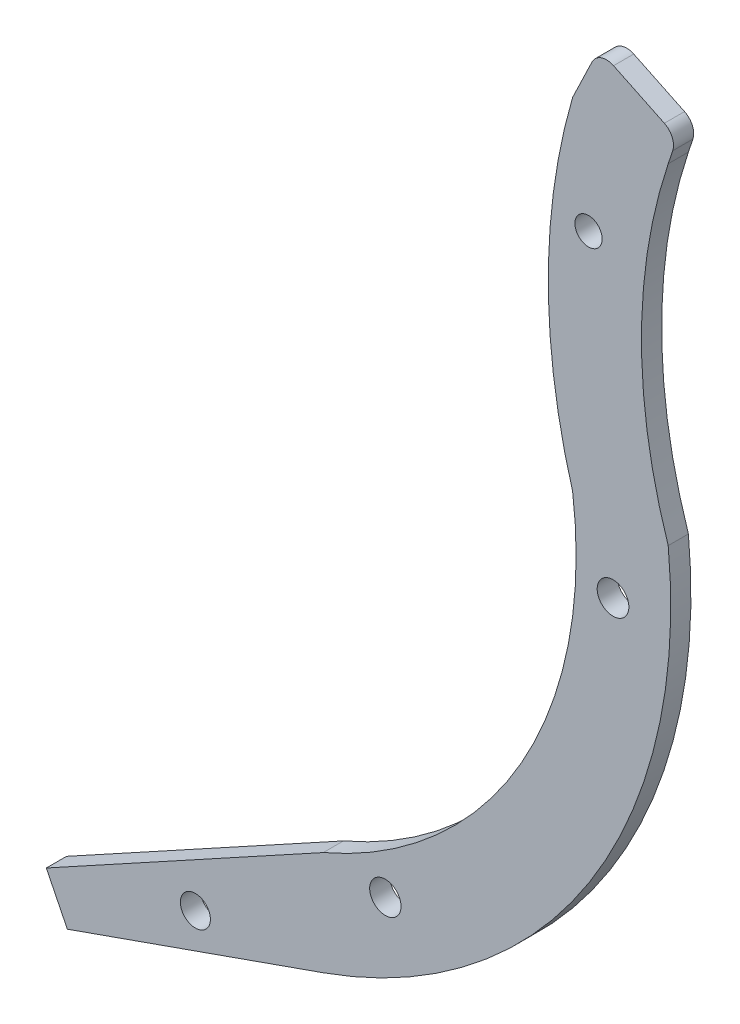
ISO-10303-21;
HEADER;
FILE_DESCRIPTION(('STEP AP214'),'2;1');
FILE_NAME('part.step','',(''),(''),'','','');
FILE_SCHEMA(('AUTOMOTIVE_DESIGN { 1 0 10303 214 1 1 1 1 }'));
ENDSEC;
DATA;
#1=APPLICATION_CONTEXT('core data for automotive mechanical design processes');
#2=APPLICATION_PROTOCOL_DEFINITION('international standard','automotive_design',2000,#1);
#3=PRODUCT_CONTEXT('',#1,'mechanical');
#4=PRODUCT('Part','Part','',(#3));
#5=PRODUCT_RELATED_PRODUCT_CATEGORY('part','',(#4));
#6=PRODUCT_DEFINITION_FORMATION('','',#4);
#7=PRODUCT_DEFINITION_CONTEXT('part definition',#1,'design');
#8=PRODUCT_DEFINITION('design','',#6,#7);
#9=PRODUCT_DEFINITION_SHAPE('','',#8);
#10=(LENGTH_UNIT() NAMED_UNIT(*) SI_UNIT(.MILLI.,.METRE.));
#11=(NAMED_UNIT(*) PLANE_ANGLE_UNIT() SI_UNIT($,.RADIAN.));
#12=(NAMED_UNIT(*) SI_UNIT($,.STERADIAN.) SOLID_ANGLE_UNIT());
#13=UNCERTAINTY_MEASURE_WITH_UNIT(LENGTH_MEASURE(1.E-05),#10,'distance_accuracy_value','');
#14=(GEOMETRIC_REPRESENTATION_CONTEXT(3) GLOBAL_UNCERTAINTY_ASSIGNED_CONTEXT((#13)) GLOBAL_UNIT_ASSIGNED_CONTEXT((#10,
#11,#12)) REPRESENTATION_CONTEXT('',''));
#15=CARTESIAN_POINT('',(0.,0.,0.));
#16=DIRECTION('',(0.,0.,1.));
#17=DIRECTION('',(1.,0.,0.));
#18=AXIS2_PLACEMENT_3D('',#15,#16,#17);
#19=CARTESIAN_POINT('',(1481.2741967776,5075.04393147781,25.));
#20=DIRECTION('',(0.,0.,1.));
#21=DIRECTION('',(1.,0.,0.));
#22=AXIS2_PLACEMENT_3D('',#19,#20,#21);
#23=PLANE('',#22);
#24=CARTESIAN_POINT('',(1772.32019542135,4586.55959532646,25.));
#25=DIRECTION('',(0.,0.,1.));
#26=DIRECTION('',(1.,0.,0.));
#27=AXIS2_PLACEMENT_3D('',#24,#25,#26);
#28=CIRCLE('',#27,19.421007654552);
#29=CARTESIAN_POINT('',(1791.7412030759,4586.55959532646,25.));
#30=VERTEX_POINT('',#29);
#31=EDGE_CURVE('E290',#30,#30,#28,.T.);
#32=ORIENTED_EDGE('',*,*,#31,.F.);
#33=EDGE_LOOP('',(#32));
#34=FACE_BOUND('',#33,.T.);
#35=CARTESIAN_POINT('',(2023.88439079889,5426.58683590153,25.));
#36=DIRECTION('',(0.,0.,1.));
#37=DIRECTION('',(1.,0.,0.));
#38=AXIS2_PLACEMENT_3D('',#35,#36,#37);
#39=CIRCLE('',#38,16.874404643465);
#40=CARTESIAN_POINT('',(2040.75879544235,5426.58683590153,25.));
#41=VERTEX_POINT('',#40);
#42=EDGE_CURVE('E157',#41,#41,#39,.T.);
#43=ORIENTED_EDGE('',*,*,#42,.F.);
#44=EDGE_LOOP('',(#43));
#45=FACE_BOUND('',#44,.T.);
#46=DIRECTION('',(0.943122141349231,0.332446426506348,0.));
#47=VECTOR('',#46,1.);
#48=CARTESIAN_POINT('',(1378.61638388743,4355.59423913519,25.));
#49=LINE('',#48,#47);
#50=CARTESIAN_POINT('',(1378.61638388743,4355.59423913519,25.));
#51=VERTEX_POINT('',#50);
#52=CARTESIAN_POINT('',(1695.50291051631,4467.29535266763,25.));
#53=VERTEX_POINT('',#52);
#54=EDGE_CURVE('E176',#51,#53,#49,.T.);
#55=ORIENTED_EDGE('',*,*,#54,.T.);
#56=CARTESIAN_POINT('',(1481.2741967776,5075.04393147781,25.));
#57=DIRECTION('',(0.,0.,1.));
#58=DIRECTION('',(1.,0.,0.));
#59=AXIS2_PLACEMENT_3D('',#56,#57,#58);
#60=CIRCLE('',#59,644.400711386893);
#61=CARTESIAN_POINT('',(2122.50962064768,5138.83584326965,25.));
#62=VERTEX_POINT('',#61);
#63=EDGE_CURVE('E104',#53,#62,#60,.T.);
#64=ORIENTED_EDGE('',*,*,#63,.T.);
#65=CARTESIAN_POINT('',(2738.65401597128,5343.53676366562,25.));
#66=DIRECTION('',(0.,0.,-1.));
#67=DIRECTION('',(1.,0.,0.));
#68=AXIS2_PLACEMENT_3D('',#65,#66,#67);
#69=CIRCLE('',#68,649.25833279184);
#70=CARTESIAN_POINT('',(2122.50962064768,5548.23768406159,25.));
#71=VERTEX_POINT('',#70);
#72=EDGE_CURVE('E203',#62,#71,#69,.T.);
#73=ORIENTED_EDGE('',*,*,#72,.T.);
#74=DIRECTION('',(0.315284240582233,0.948997285370451,0.));
#75=VECTOR('',#74,1.);
#76=CARTESIAN_POINT('',(2122.50962064768,5548.23768406159,25.));
#77=LINE('',#76,#75);
#78=CARTESIAN_POINT('',(2128.06247751587,5564.95163742709,25.));
#79=VERTEX_POINT('',#78);
#80=EDGE_CURVE('E222',#71,#79,#77,.T.);
#81=ORIENTED_EDGE('',*,*,#80,.T.);
#82=CARTESIAN_POINT('',(2109.08253180847,5571.25732223873,25.));
#83=DIRECTION('',(0.,0.,1.));
#84=DIRECTION('',(1.,0.,0.));
#85=AXIS2_PLACEMENT_3D('',#82,#83,#84);
#86=CIRCLE('',#85,19.9999999999999);
#87=CARTESIAN_POINT('',(2117.74855848933,5589.28230439036,25.));
#88=VERTEX_POINT('',#87);
#89=EDGE_CURVE('E219',#79,#88,#86,.T.);
#90=ORIENTED_EDGE('',*,*,#89,.T.);
#91=DIRECTION('',(-0.901249107581444,0.43330133404324,0.));
#92=VECTOR('',#91,1.);
#93=CARTESIAN_POINT('',(2054.85786628093,5619.51880682189,25.));
#94=LINE('',#93,#92);
#95=CARTESIAN_POINT('',(2054.85786628093,5619.51880682189,25.));
#96=VERTEX_POINT('',#95);
#97=EDGE_CURVE('E221',#88,#96,#94,.T.);
#98=ORIENTED_EDGE('',*,*,#97,.T.);
#99=CARTESIAN_POINT('',(2046.19183960007,5601.49382467026,25.));
#100=DIRECTION('',(0.,0.,1.));
#101=DIRECTION('',(-1.,0.,0.));
#102=AXIS2_PLACEMENT_3D('',#99,#100,#101);
#103=CIRCLE('',#102,19.9999999999996);
#104=CARTESIAN_POINT('',(2028.16685744844,5610.15985135113,25.));
#105=VERTEX_POINT('',#104);
#106=EDGE_CURVE('E224',#96,#105,#103,.T.);
#107=ORIENTED_EDGE('',*,*,#106,.T.);
#108=DIRECTION('',(-0.433301334043249,-0.90124910758144,0.));
#109=VECTOR('',#108,1.);
#110=CARTESIAN_POINT('',(2004.19861926016,5560.30689318939,25.));
#111=LINE('',#110,#109);
#112=CARTESIAN_POINT('',(2004.19861926016,5560.30689318939,25.));
#113=VERTEX_POINT('',#112);
#114=EDGE_CURVE('E230',#105,#113,#111,.T.);
#115=ORIENTED_EDGE('',*,*,#114,.T.);
#116=CARTESIAN_POINT('',(2729.43156154614,5348.96743241331,25.));
#117=DIRECTION('',(0.,0.,1.));
#118=DIRECTION('',(1.,0.,0.));
#119=AXIS2_PLACEMENT_3D('',#116,#117,#118);
#120=CIRCLE('',#119,755.39869490085);
#121=CARTESIAN_POINT('',(2004.19861926025,5137.62797163692,25.));
#122=VERTEX_POINT('',#121);
#123=EDGE_CURVE('E135',#113,#122,#120,.T.);
#124=ORIENTED_EDGE('',*,*,#123,.T.);
#125=CARTESIAN_POINT('',(1492.3414023733,5070.74550987782,25.));
#126=DIRECTION('',(0.,0.,-1.));
#127=DIRECTION('',(1.,0.,0.));
#128=AXIS2_PLACEMENT_3D('',#125,#126,#127);
#129=CIRCLE('',#128,516.208363134704);
#130=CARTESIAN_POINT('',(1695.50291051643,4596.19680238909,25.));
#131=VERTEX_POINT('',#130);
#132=EDGE_CURVE('E129',#122,#131,#129,.T.);
#133=ORIENTED_EDGE('',*,*,#132,.T.);
#134=DIRECTION('',(-0.87685590010257,-0.480753294794026,0.));
#135=VECTOR('',#134,1.);
#136=CARTESIAN_POINT('',(1352.57800401076,4408.18155535677,25.));
#137=LINE('',#136,#135);
#138=CARTESIAN_POINT('',(1352.57800401076,4408.18155535677,25.));
#139=VERTEX_POINT('',#138);
#140=EDGE_CURVE('E133',#131,#139,#137,.T.);
#141=ORIENTED_EDGE('',*,*,#140,.T.);
#142=DIRECTION('',(0.443729974971728,-0.896160537689308,0.));
#143=VECTOR('',#142,1.);
#144=CARTESIAN_POINT('',(1352.57800401076,4408.18155535677,25.));
#145=LINE('',#144,#143);
#146=EDGE_CURVE('E49',#139,#51,#145,.T.);
#147=ORIENTED_EDGE('',*,*,#146,.T.);
#148=EDGE_LOOP('',(#55,#64,#73,#81,#90,#98,#107,#115,#124,#133,#141,#147));
#149=FACE_BOUND('',#148,.T.);
#150=CARTESIAN_POINT('',(2054.18617661763,5048.55362164354,25.));
#151=DIRECTION('',(0.,0.,1.));
#152=DIRECTION('',(1.,0.,0.));
#153=AXIS2_PLACEMENT_3D('',#150,#151,#152);
#154=CIRCLE('',#153,19.6094972810679);
#155=CARTESIAN_POINT('',(2073.7956738987,5048.55362164354,25.));
#156=VERTEX_POINT('',#155);
#157=EDGE_CURVE('E296',#156,#156,#154,.T.);
#158=ORIENTED_EDGE('',*,*,#157,.F.);
#159=EDGE_LOOP('',(#158));
#160=FACE_BOUND('',#159,.T.);
#161=CARTESIAN_POINT('',(1537.12455693095,4454.63725072721,25.));
#162=DIRECTION('',(0.,0.,1.));
#163=DIRECTION('',(1.,0.,0.));
#164=AXIS2_PLACEMENT_3D('',#161,#162,#163);
#165=CIRCLE('',#164,18.5820630731595);
#166=CARTESIAN_POINT('',(1555.70662000411,4454.63725072721,25.));
#167=VERTEX_POINT('',#166);
#168=EDGE_CURVE('E281',#167,#167,#165,.T.);
#169=ORIENTED_EDGE('',*,*,#168,.F.);
#170=EDGE_LOOP('',(#169));
#171=FACE_BOUND('',#170,.T.);
#172=ADVANCED_FACE('F32',(#34,#45,#149,#160,#171),#23,.T.);
#173=CARTESIAN_POINT('',(1481.2741967776,5075.04393147781,0.));
#174=DIRECTION('',(0.,0.,1.));
#175=DIRECTION('',(1.,0.,0.));
#176=AXIS2_PLACEMENT_3D('',#173,#174,#175);
#177=PLANE('',#176);
#178=DIRECTION('',(0.943122141349231,0.332446426506348,0.));
#179=VECTOR('',#178,1.);
#180=CARTESIAN_POINT('',(1378.61638388743,4355.59423913519,0.));
#181=LINE('',#180,#179);
#182=CARTESIAN_POINT('',(1378.61638388743,4355.59423913519,0.));
#183=VERTEX_POINT('',#182);
#184=CARTESIAN_POINT('',(1695.50291051631,4467.29535266763,0.));
#185=VERTEX_POINT('',#184);
#186=EDGE_CURVE('E153',#183,#185,#181,.T.);
#187=ORIENTED_EDGE('',*,*,#186,.F.);
#188=DIRECTION('',(0.443729974971728,-0.896160537689308,0.));
#189=VECTOR('',#188,1.);
#190=CARTESIAN_POINT('',(1352.57800401076,4408.18155535677,0.));
#191=LINE('',#190,#189);
#192=CARTESIAN_POINT('',(1352.57800401076,4408.18155535677,0.));
#193=VERTEX_POINT('',#192);
#194=EDGE_CURVE('E96',#193,#183,#191,.T.);
#195=ORIENTED_EDGE('',*,*,#194,.F.);
#196=DIRECTION('',(-0.87685590010257,-0.480753294794026,0.));
#197=VECTOR('',#196,1.);
#198=CARTESIAN_POINT('',(1352.57800401076,4408.18155535677,0.));
#199=LINE('',#198,#197);
#200=CARTESIAN_POINT('',(1695.50291051643,4596.19680238909,0.));
#201=VERTEX_POINT('',#200);
#202=EDGE_CURVE('E90',#201,#193,#199,.T.);
#203=ORIENTED_EDGE('',*,*,#202,.F.);
#204=CARTESIAN_POINT('',(1492.3414023733,5070.74550987782,0.));
#205=DIRECTION('',(0.,0.,-1.));
#206=DIRECTION('',(1.,0.,0.));
#207=AXIS2_PLACEMENT_3D('',#204,#205,#206);
#208=CIRCLE('',#207,516.208363134704);
#209=CARTESIAN_POINT('',(2004.19861926025,5137.62797163692,0.));
#210=VERTEX_POINT('',#209);
#211=EDGE_CURVE('E143',#210,#201,#208,.T.);
#212=ORIENTED_EDGE('',*,*,#211,.F.);
#213=CARTESIAN_POINT('',(2729.43156154614,5348.96743241331,0.));
#214=DIRECTION('',(0.,0.,1.));
#215=DIRECTION('',(1.,0.,0.));
#216=AXIS2_PLACEMENT_3D('',#213,#214,#215);
#217=CIRCLE('',#216,755.39869490085);
#218=CARTESIAN_POINT('',(2004.19861926016,5560.30689318939,0.));
#219=VERTEX_POINT('',#218);
#220=EDGE_CURVE('E171',#219,#210,#217,.T.);
#221=ORIENTED_EDGE('',*,*,#220,.F.);
#222=DIRECTION('',(-0.433301334043249,-0.90124910758144,0.));
#223=VECTOR('',#222,1.);
#224=CARTESIAN_POINT('',(2004.19861926016,5560.30689318939,0.));
#225=LINE('',#224,#223);
#226=CARTESIAN_POINT('',(2028.16685744844,5610.15985135113,0.));
#227=VERTEX_POINT('',#226);
#228=EDGE_CURVE('E169',#227,#219,#225,.T.);
#229=ORIENTED_EDGE('',*,*,#228,.F.);
#230=CARTESIAN_POINT('',(2046.19183960007,5601.49382467026,0.));
#231=DIRECTION('',(0.,0.,1.));
#232=DIRECTION('',(-1.,0.,0.));
#233=AXIS2_PLACEMENT_3D('',#230,#231,#232);
#234=CIRCLE('',#233,19.9999999999996);
#235=CARTESIAN_POINT('',(2054.85786628093,5619.51880682189,0.));
#236=VERTEX_POINT('',#235);
#237=EDGE_CURVE('E167',#236,#227,#234,.T.);
#238=ORIENTED_EDGE('',*,*,#237,.F.);
#239=DIRECTION('',(-0.901249107581444,0.43330133404324,0.));
#240=VECTOR('',#239,1.);
#241=CARTESIAN_POINT('',(2054.85786628093,5619.51880682189,0.));
#242=LINE('',#241,#240);
#243=CARTESIAN_POINT('',(2117.74855848933,5589.28230439036,0.));
#244=VERTEX_POINT('',#243);
#245=EDGE_CURVE('E165',#244,#236,#242,.T.);
#246=ORIENTED_EDGE('',*,*,#245,.F.);
#247=CARTESIAN_POINT('',(2109.08253180847,5571.25732223873,0.));
#248=DIRECTION('',(0.,0.,1.));
#249=DIRECTION('',(1.,0.,0.));
#250=AXIS2_PLACEMENT_3D('',#247,#248,#249);
#251=CIRCLE('',#250,19.9999999999999);
#252=CARTESIAN_POINT('',(2128.06247751587,5564.95163742709,0.));
#253=VERTEX_POINT('',#252);
#254=EDGE_CURVE('E163',#253,#244,#251,.T.);
#255=ORIENTED_EDGE('',*,*,#254,.F.);
#256=DIRECTION('',(0.315284240582233,0.948997285370451,0.));
#257=VECTOR('',#256,1.);
#258=CARTESIAN_POINT('',(2122.50962064768,5548.23768406159,0.));
#259=LINE('',#258,#257);
#260=CARTESIAN_POINT('',(2122.50962064768,5548.23768406159,0.));
#261=VERTEX_POINT('',#260);
#262=EDGE_CURVE('E161',#261,#253,#259,.T.);
#263=ORIENTED_EDGE('',*,*,#262,.F.);
#264=CARTESIAN_POINT('',(2738.65401597128,5343.53676366562,0.));
#265=DIRECTION('',(0.,0.,-1.));
#266=DIRECTION('',(1.,0.,0.));
#267=AXIS2_PLACEMENT_3D('',#264,#265,#266);
#268=CIRCLE('',#267,649.25833279184);
#269=CARTESIAN_POINT('',(2122.50962064768,5138.83584326965,0.));
#270=VERTEX_POINT('',#269);
#271=EDGE_CURVE('E159',#270,#261,#268,.T.);
#272=ORIENTED_EDGE('',*,*,#271,.F.);
#273=CARTESIAN_POINT('',(1481.2741967776,5075.04393147781,0.));
#274=DIRECTION('',(0.,0.,1.));
#275=DIRECTION('',(1.,0.,0.));
#276=AXIS2_PLACEMENT_3D('',#273,#274,#275);
#277=CIRCLE('',#276,644.400711386893);
#278=EDGE_CURVE('E156',#185,#270,#277,.T.);
#279=ORIENTED_EDGE('',*,*,#278,.F.);
#280=EDGE_LOOP('',(#187,#195,#203,#212,#221,#229,#238,#246,#255,#263,#272,#279));
#281=FACE_BOUND('',#280,.T.);
#282=CARTESIAN_POINT('',(2023.88439079889,5426.58683590153,0.));
#283=DIRECTION('',(0.,0.,1.));
#284=DIRECTION('',(1.,0.,0.));
#285=AXIS2_PLACEMENT_3D('',#282,#283,#284);
#286=CIRCLE('',#285,16.874404643465);
#287=CARTESIAN_POINT('',(2040.75879544235,5426.58683590153,0.));
#288=VERTEX_POINT('',#287);
#289=EDGE_CURVE('E299',#288,#288,#286,.T.);
#290=ORIENTED_EDGE('',*,*,#289,.T.);
#291=EDGE_LOOP('',(#290));
#292=FACE_BOUND('',#291,.T.);
#293=CARTESIAN_POINT('',(2054.18617661763,5048.55362164354,0.));
#294=DIRECTION('',(0.,0.,1.));
#295=DIRECTION('',(1.,0.,0.));
#296=AXIS2_PLACEMENT_3D('',#293,#294,#295);
#297=CIRCLE('',#296,19.6094972810679);
#298=CARTESIAN_POINT('',(2073.7956738987,5048.55362164354,0.));
#299=VERTEX_POINT('',#298);
#300=EDGE_CURVE('E293',#299,#299,#297,.T.);
#301=ORIENTED_EDGE('',*,*,#300,.T.);
#302=EDGE_LOOP('',(#301));
#303=FACE_BOUND('',#302,.T.);
#304=CARTESIAN_POINT('',(1772.32019542135,4586.55959532646,0.));
#305=DIRECTION('',(0.,0.,1.));
#306=DIRECTION('',(1.,0.,0.));
#307=AXIS2_PLACEMENT_3D('',#304,#305,#306);
#308=CIRCLE('',#307,19.421007654552);
#309=CARTESIAN_POINT('',(1791.7412030759,4586.55959532646,0.));
#310=VERTEX_POINT('',#309);
#311=EDGE_CURVE('E287',#310,#310,#308,.T.);
#312=ORIENTED_EDGE('',*,*,#311,.T.);
#313=EDGE_LOOP('',(#312));
#314=FACE_BOUND('',#313,.T.);
#315=CARTESIAN_POINT('',(1537.12455693095,4454.63725072721,0.));
#316=DIRECTION('',(0.,0.,1.));
#317=DIRECTION('',(1.,0.,0.));
#318=AXIS2_PLACEMENT_3D('',#315,#316,#317);
#319=CIRCLE('',#318,18.5820630731595);
#320=CARTESIAN_POINT('',(1555.70662000411,4454.63725072721,0.));
#321=VERTEX_POINT('',#320);
#322=EDGE_CURVE('E284',#321,#321,#319,.T.);
#323=ORIENTED_EDGE('',*,*,#322,.T.);
#324=EDGE_LOOP('',(#323));
#325=FACE_BOUND('',#324,.T.);
#326=ADVANCED_FACE('F207',(#281,#292,#303,#314,#325),#177,.F.);
#327=CARTESIAN_POINT('',(1378.61638388743,4355.59423913519,25.));
#328=DIRECTION('',(-0.332446426506348,0.943122141349231,0.));
#329=DIRECTION('',(-0.943122141349231,-0.332446426506348,0.));
#330=AXIS2_PLACEMENT_3D('',#327,#328,#329);
#331=PLANE('',#330);
#332=ORIENTED_EDGE('',*,*,#186,.T.);
#333=DIRECTION('',(0.,0.,-1.));
#334=VECTOR('',#333,1.);
#335=CARTESIAN_POINT('',(1695.50291051631,4467.29535266763,25.));
#336=LINE('',#335,#334);
#337=EDGE_CURVE('E11',#53,#185,#336,.T.);
#338=ORIENTED_EDGE('',*,*,#337,.F.);
#339=ORIENTED_EDGE('',*,*,#54,.F.);
#340=DIRECTION('',(0.,0.,-1.));
#341=VECTOR('',#340,1.);
#342=CARTESIAN_POINT('',(1378.61638388743,4355.59423913519,25.));
#343=LINE('',#342,#341);
#344=EDGE_CURVE('E149',#51,#183,#343,.T.);
#345=ORIENTED_EDGE('',*,*,#344,.T.);
#346=EDGE_LOOP('',(#332,#338,#339,#345));
#347=FACE_BOUND('',#346,.T.);
#348=ADVANCED_FACE('F34',(#347),#331,.F.);
#349=CARTESIAN_POINT('',(1481.2741967776,5075.04393147781,25.));
#350=DIRECTION('',(0.,0.,-1.));
#351=DIRECTION('',(-1.,0.,0.));
#352=AXIS2_PLACEMENT_3D('',#349,#350,#351);
#353=CYLINDRICAL_SURFACE('',#352,644.400711386893);
#354=ORIENTED_EDGE('',*,*,#278,.T.);
#355=DIRECTION('',(0.,0.,-1.));
#356=VECTOR('',#355,1.);
#357=CARTESIAN_POINT('',(2122.50962064768,5138.83584326965,25.));
#358=LINE('',#357,#356);
#359=EDGE_CURVE('E41',#62,#270,#358,.T.);
#360=ORIENTED_EDGE('',*,*,#359,.F.);
#361=ORIENTED_EDGE('',*,*,#63,.F.);
#362=ORIENTED_EDGE('',*,*,#337,.T.);
#363=EDGE_LOOP('',(#354,#360,#361,#362));
#364=FACE_BOUND('',#363,.T.);
#365=ADVANCED_FACE('F414',(#364),#353,.T.);
#366=CARTESIAN_POINT('',(2738.65401597128,5343.53676366562,25.));
#367=DIRECTION('',(0.,0.,-1.));
#368=DIRECTION('',(-1.,0.,0.));
#369=AXIS2_PLACEMENT_3D('',#366,#367,#368);
#370=CYLINDRICAL_SURFACE('',#369,649.25833279184);
#371=ORIENTED_EDGE('',*,*,#271,.T.);
#372=DIRECTION('',(0.,0.,-1.));
#373=VECTOR('',#372,1.);
#374=CARTESIAN_POINT('',(2122.50962064768,5548.23768406159,25.));
#375=LINE('',#374,#373);
#376=EDGE_CURVE('E195',#71,#261,#375,.T.);
#377=ORIENTED_EDGE('',*,*,#376,.F.);
#378=ORIENTED_EDGE('',*,*,#72,.F.);
#379=ORIENTED_EDGE('',*,*,#359,.T.);
#380=EDGE_LOOP('',(#371,#377,#378,#379));
#381=FACE_BOUND('',#380,.T.);
#382=ADVANCED_FACE('F201',(#381),#370,.F.);
#383=CARTESIAN_POINT('',(2122.50962064768,5548.23768406159,25.));
#384=DIRECTION('',(-0.948997285370451,0.315284240582233,0.));
#385=DIRECTION('',(-0.315284240582233,-0.948997285370451,0.));
#386=AXIS2_PLACEMENT_3D('',#383,#384,#385);
#387=PLANE('',#386);
#388=ORIENTED_EDGE('',*,*,#262,.T.);
#389=DIRECTION('',(0.,0.,-1.));
#390=VECTOR('',#389,1.);
#391=CARTESIAN_POINT('',(2128.06247751587,5564.95163742709,25.));
#392=LINE('',#391,#390);
#393=EDGE_CURVE('E192',#79,#253,#392,.T.);
#394=ORIENTED_EDGE('',*,*,#393,.F.);
#395=ORIENTED_EDGE('',*,*,#80,.F.);
#396=ORIENTED_EDGE('',*,*,#376,.T.);
#397=EDGE_LOOP('',(#388,#394,#395,#396));
#398=FACE_BOUND('',#397,.T.);
#399=ADVANCED_FACE('F213',(#398),#387,.F.);
#400=CARTESIAN_POINT('',(2109.08253180847,5571.25732223873,25.));
#401=DIRECTION('',(0.,0.,-1.));
#402=DIRECTION('',(-1.,0.,0.));
#403=AXIS2_PLACEMENT_3D('',#400,#401,#402);
#404=CYLINDRICAL_SURFACE('',#403,19.9999999999999);
#405=ORIENTED_EDGE('',*,*,#254,.T.);
#406=DIRECTION('',(0.,0.,-1.));
#407=VECTOR('',#406,1.);
#408=CARTESIAN_POINT('',(2117.74855848933,5589.28230439036,25.));
#409=LINE('',#408,#407);
#410=EDGE_CURVE('E189',#88,#244,#409,.T.);
#411=ORIENTED_EDGE('',*,*,#410,.F.);
#412=ORIENTED_EDGE('',*,*,#89,.F.);
#413=ORIENTED_EDGE('',*,*,#393,.T.);
#414=EDGE_LOOP('',(#405,#411,#412,#413));
#415=FACE_BOUND('',#414,.T.);
#416=ADVANCED_FACE('F217',(#415),#404,.T.);
#417=CARTESIAN_POINT('',(2054.85786628093,5619.51880682189,25.));
#418=DIRECTION('',(-0.43330133404324,-0.901249107581444,0.));
#419=DIRECTION('',(0.901249107581444,-0.43330133404324,0.));
#420=AXIS2_PLACEMENT_3D('',#417,#418,#419);
#421=PLANE('',#420);
#422=ORIENTED_EDGE('',*,*,#245,.T.);
#423=DIRECTION('',(0.,0.,-1.));
#424=VECTOR('',#423,1.);
#425=CARTESIAN_POINT('',(2054.85786628093,5619.51880682189,25.));
#426=LINE('',#425,#424);
#427=EDGE_CURVE('E186',#96,#236,#426,.T.);
#428=ORIENTED_EDGE('',*,*,#427,.F.);
#429=ORIENTED_EDGE('',*,*,#97,.F.);
#430=ORIENTED_EDGE('',*,*,#410,.T.);
#431=EDGE_LOOP('',(#422,#428,#429,#430));
#432=FACE_BOUND('',#431,.T.);
#433=ADVANCED_FACE('F379',(#432),#421,.F.);
#434=CARTESIAN_POINT('',(2046.19183960007,5601.49382467026,25.));
#435=DIRECTION('',(0.,0.,-1.));
#436=DIRECTION('',(-1.,0.,0.));
#437=AXIS2_PLACEMENT_3D('',#434,#435,#436);
#438=CYLINDRICAL_SURFACE('',#437,19.9999999999996);
#439=ORIENTED_EDGE('',*,*,#237,.T.);
#440=DIRECTION('',(0.,0.,-1.));
#441=VECTOR('',#440,1.);
#442=CARTESIAN_POINT('',(2028.16685744844,5610.15985135113,25.));
#443=LINE('',#442,#441);
#444=EDGE_CURVE('E183',#105,#227,#443,.T.);
#445=ORIENTED_EDGE('',*,*,#444,.F.);
#446=ORIENTED_EDGE('',*,*,#106,.F.);
#447=ORIENTED_EDGE('',*,*,#427,.T.);
#448=EDGE_LOOP('',(#439,#445,#446,#447));
#449=FACE_BOUND('',#448,.T.);
#450=ADVANCED_FACE('F370',(#449),#438,.T.);
#451=CARTESIAN_POINT('',(2004.19861926016,5560.30689318939,25.));
#452=DIRECTION('',(0.90124910758144,-0.433301334043249,0.));
#453=DIRECTION('',(0.433301334043249,0.90124910758144,0.));
#454=AXIS2_PLACEMENT_3D('',#451,#452,#453);
#455=PLANE('',#454);
#456=ORIENTED_EDGE('',*,*,#228,.T.);
#457=DIRECTION('',(0.,0.,-1.));
#458=VECTOR('',#457,1.);
#459=CARTESIAN_POINT('',(2004.19861926016,5560.30689318939,25.));
#460=LINE('',#459,#458);
#461=EDGE_CURVE('E180',#113,#219,#460,.T.);
#462=ORIENTED_EDGE('',*,*,#461,.F.);
#463=ORIENTED_EDGE('',*,*,#114,.F.);
#464=ORIENTED_EDGE('',*,*,#444,.T.);
#465=EDGE_LOOP('',(#456,#462,#463,#464));
#466=FACE_BOUND('',#465,.T.);
#467=ADVANCED_FACE('F236',(#466),#455,.F.);
#468=CARTESIAN_POINT('',(2729.43156154614,5348.96743241331,25.));
#469=DIRECTION('',(0.,0.,-1.));
#470=DIRECTION('',(-1.,0.,0.));
#471=AXIS2_PLACEMENT_3D('',#468,#469,#470);
#472=CYLINDRICAL_SURFACE('',#471,755.39869490085);
#473=ORIENTED_EDGE('',*,*,#220,.T.);
#474=DIRECTION('',(0.,0.,-1.));
#475=VECTOR('',#474,1.);
#476=CARTESIAN_POINT('',(2004.19861926025,5137.62797163692,25.));
#477=LINE('',#476,#475);
#478=EDGE_CURVE('E144',#122,#210,#477,.T.);
#479=ORIENTED_EDGE('',*,*,#478,.F.);
#480=ORIENTED_EDGE('',*,*,#123,.F.);
#481=ORIENTED_EDGE('',*,*,#461,.T.);
#482=EDGE_LOOP('',(#473,#479,#480,#481));
#483=FACE_BOUND('',#482,.T.);
#484=ADVANCED_FACE('F240',(#483),#472,.T.);
#485=CARTESIAN_POINT('',(1492.3414023733,5070.74550987782,25.));
#486=DIRECTION('',(0.,0.,-1.));
#487=DIRECTION('',(-1.,0.,0.));
#488=AXIS2_PLACEMENT_3D('',#485,#486,#487);
#489=CYLINDRICAL_SURFACE('',#488,516.208363134704);
#490=ORIENTED_EDGE('',*,*,#211,.T.);
#491=DIRECTION('',(0.,0.,-1.));
#492=VECTOR('',#491,1.);
#493=CARTESIAN_POINT('',(1695.50291051643,4596.19680238909,25.));
#494=LINE('',#493,#492);
#495=EDGE_CURVE('E140',#131,#201,#494,.T.);
#496=ORIENTED_EDGE('',*,*,#495,.F.);
#497=ORIENTED_EDGE('',*,*,#132,.F.);
#498=ORIENTED_EDGE('',*,*,#478,.T.);
#499=EDGE_LOOP('',(#490,#496,#497,#498));
#500=FACE_BOUND('',#499,.T.);
#501=ADVANCED_FACE('F141',(#500),#489,.F.);
#502=CARTESIAN_POINT('',(1352.57800401076,4408.18155535677,25.));
#503=DIRECTION('',(0.480753294794027,-0.87685590010257,0.));
#504=DIRECTION('',(0.87685590010257,0.480753294794027,0.));
#505=AXIS2_PLACEMENT_3D('',#502,#503,#504);
#506=PLANE('',#505);
#507=ORIENTED_EDGE('',*,*,#202,.T.);
#508=DIRECTION('',(0.,0.,-1.));
#509=VECTOR('',#508,1.);
#510=CARTESIAN_POINT('',(1352.57800401076,4408.18155535677,25.));
#511=LINE('',#510,#509);
#512=EDGE_CURVE('E145',#139,#193,#511,.T.);
#513=ORIENTED_EDGE('',*,*,#512,.F.);
#514=ORIENTED_EDGE('',*,*,#140,.F.);
#515=ORIENTED_EDGE('',*,*,#495,.T.);
#516=EDGE_LOOP('',(#507,#513,#514,#515));
#517=FACE_BOUND('',#516,.T.);
#518=ADVANCED_FACE('F147',(#517),#506,.F.);
#519=CARTESIAN_POINT('',(1352.57800401076,4408.18155535677,25.));
#520=DIRECTION('',(0.896160537689308,0.443729974971728,0.));
#521=DIRECTION('',(-0.443729974971728,0.896160537689308,0.));
#522=AXIS2_PLACEMENT_3D('',#519,#520,#521);
#523=PLANE('',#522);
#524=ORIENTED_EDGE('',*,*,#194,.T.);
#525=ORIENTED_EDGE('',*,*,#344,.F.);
#526=ORIENTED_EDGE('',*,*,#146,.F.);
#527=ORIENTED_EDGE('',*,*,#512,.T.);
#528=EDGE_LOOP('',(#524,#525,#526,#527));
#529=FACE_BOUND('',#528,.T.);
#530=ADVANCED_FACE('F244',(#529),#523,.F.);
#531=CARTESIAN_POINT('',(2023.88439079889,5426.58683590153,25.));
#532=DIRECTION('',(0.,0.,-1.));
#533=DIRECTION('',(-1.,0.,0.));
#534=AXIS2_PLACEMENT_3D('',#531,#532,#533);
#535=CYLINDRICAL_SURFACE('',#534,16.874404643465);
#536=ORIENTED_EDGE('',*,*,#42,.T.);
#537=EDGE_LOOP('',(#536));
#538=FACE_BOUND('',#537,.T.);
#539=ORIENTED_EDGE('',*,*,#289,.F.);
#540=EDGE_LOOP('',(#539));
#541=FACE_BOUND('',#540,.T.);
#542=ADVANCED_FACE('F246',(#538,#541),#535,.F.);
#543=CARTESIAN_POINT('',(2054.18617661763,5048.55362164354,25.));
#544=DIRECTION('',(0.,0.,-1.));
#545=DIRECTION('',(-1.,0.,0.));
#546=AXIS2_PLACEMENT_3D('',#543,#544,#545);
#547=CYLINDRICAL_SURFACE('',#546,19.6094972810679);
#548=ORIENTED_EDGE('',*,*,#157,.T.);
#549=EDGE_LOOP('',(#548));
#550=FACE_BOUND('',#549,.T.);
#551=ORIENTED_EDGE('',*,*,#300,.F.);
#552=EDGE_LOOP('',(#551));
#553=FACE_BOUND('',#552,.T.);
#554=ADVANCED_FACE('F252',(#550,#553),#547,.F.);
#555=CARTESIAN_POINT('',(1772.32019542135,4586.55959532646,25.));
#556=DIRECTION('',(0.,0.,-1.));
#557=DIRECTION('',(-1.,0.,0.));
#558=AXIS2_PLACEMENT_3D('',#555,#556,#557);
#559=CYLINDRICAL_SURFACE('',#558,19.421007654552);
#560=ORIENTED_EDGE('',*,*,#31,.T.);
#561=EDGE_LOOP('',(#560));
#562=FACE_BOUND('',#561,.T.);
#563=ORIENTED_EDGE('',*,*,#311,.F.);
#564=EDGE_LOOP('',(#563));
#565=FACE_BOUND('',#564,.T.);
#566=ADVANCED_FACE('F268',(#562,#565),#559,.F.);
#567=CARTESIAN_POINT('',(1537.12455693095,4454.63725072721,25.));
#568=DIRECTION('',(0.,0.,-1.));
#569=DIRECTION('',(-1.,0.,0.));
#570=AXIS2_PLACEMENT_3D('',#567,#568,#569);
#571=CYLINDRICAL_SURFACE('',#570,18.5820630731595);
#572=ORIENTED_EDGE('',*,*,#168,.T.);
#573=EDGE_LOOP('',(#572));
#574=FACE_BOUND('',#573,.T.);
#575=ORIENTED_EDGE('',*,*,#322,.F.);
#576=EDGE_LOOP('',(#575));
#577=FACE_BOUND('',#576,.T.);
#578=ADVANCED_FACE('F272',(#574,#577),#571,.F.);
#579=CLOSED_SHELL('',(#172,#326,#348,#365,#382,#399,#416,#433,#450,#467,#484,#501,#518,#530,
#542,#554,#566,#578));
#580=MANIFOLD_SOLID_BREP('B2',#579);
#581=ADVANCED_BREP_SHAPE_REPRESENTATION('',(#18,#580),#14);
#582=SHAPE_DEFINITION_REPRESENTATION(#9,#581);
ENDSEC;
END-ISO-10303-21;
